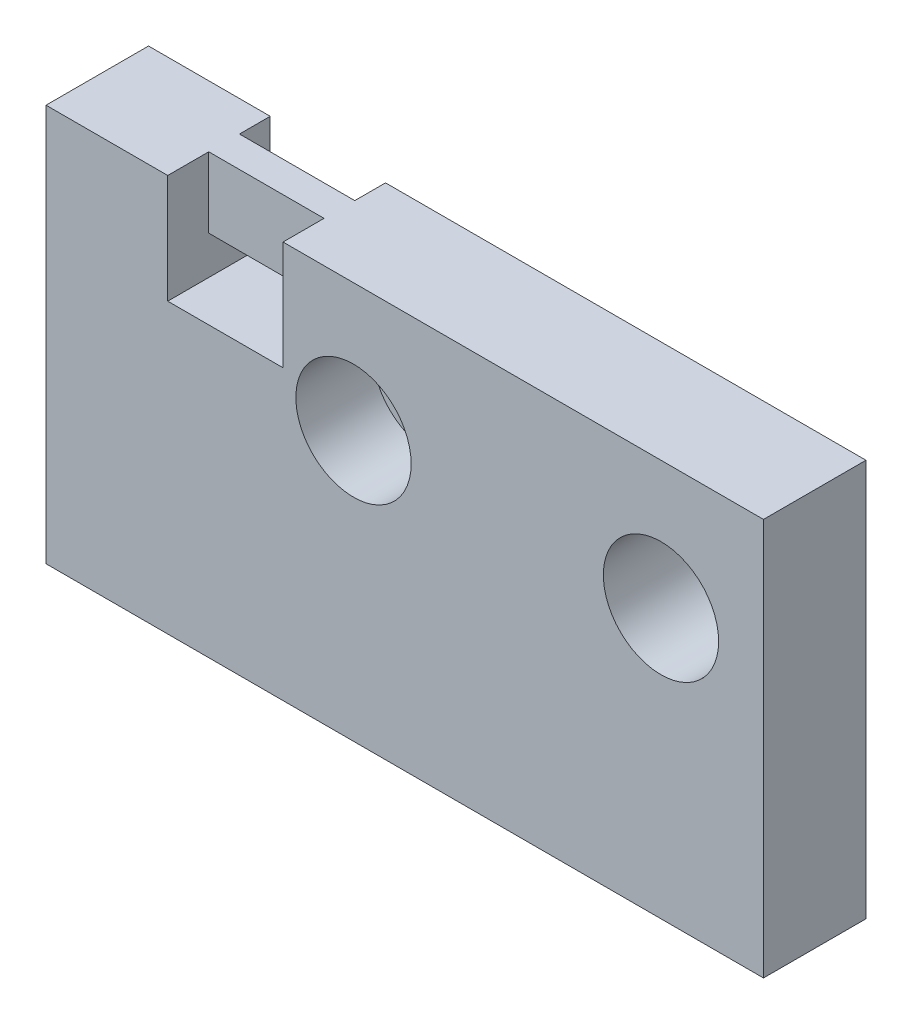
ISO-10303-21;
HEADER;
FILE_DESCRIPTION(('STEP AP214'),'2;1');
FILE_NAME('part.step','',(''),(''),'','','');
FILE_SCHEMA(('AUTOMOTIVE_DESIGN { 1 0 10303 214 1 1 1 1 }'));
ENDSEC;
DATA;
#1=APPLICATION_CONTEXT('core data for automotive mechanical design processes');
#2=APPLICATION_PROTOCOL_DEFINITION('international standard','automotive_design',2000,#1);
#3=PRODUCT_CONTEXT('',#1,'mechanical');
#4=PRODUCT('Part','Part','',(#3));
#5=PRODUCT_RELATED_PRODUCT_CATEGORY('part','',(#4));
#6=PRODUCT_DEFINITION_FORMATION('','',#4);
#7=PRODUCT_DEFINITION_CONTEXT('part definition',#1,'design');
#8=PRODUCT_DEFINITION('design','',#6,#7);
#9=PRODUCT_DEFINITION_SHAPE('','',#8);
#10=(LENGTH_UNIT() NAMED_UNIT(*) SI_UNIT(.MILLI.,.METRE.));
#11=(NAMED_UNIT(*) PLANE_ANGLE_UNIT() SI_UNIT($,.RADIAN.));
#12=(NAMED_UNIT(*) SI_UNIT($,.STERADIAN.) SOLID_ANGLE_UNIT());
#13=UNCERTAINTY_MEASURE_WITH_UNIT(LENGTH_MEASURE(1.E-05),#10,'distance_accuracy_value','');
#14=(GEOMETRIC_REPRESENTATION_CONTEXT(3) GLOBAL_UNCERTAINTY_ASSIGNED_CONTEXT((#13)) GLOBAL_UNIT_ASSIGNED_CONTEXT((#10,
#11,#12)) REPRESENTATION_CONTEXT('',''));
#15=CARTESIAN_POINT('',(0.,0.,0.));
#16=DIRECTION('',(0.,0.,1.));
#17=DIRECTION('',(1.,0.,0.));
#18=AXIS2_PLACEMENT_3D('',#15,#16,#17);
#19=CARTESIAN_POINT('',(12.,-5.,0.));
#20=DIRECTION('',(0.,0.,1.));
#21=DIRECTION('',(1.,0.,0.));
#22=AXIS2_PLACEMENT_3D('',#19,#20,#21);
#23=CYLINDRICAL_SURFACE('',#22,1.25);
#24=CARTESIAN_POINT('',(12.,-5.,0.));
#25=DIRECTION('',(0.,0.,1.));
#26=DIRECTION('',(1.,0.,0.));
#27=AXIS2_PLACEMENT_3D('',#24,#25,#26);
#28=CIRCLE('',#27,1.25);
#29=CARTESIAN_POINT('',(13.25,-5.,0.));
#30=VERTEX_POINT('',#29);
#31=EDGE_CURVE('E187',#30,#30,#28,.T.);
#32=ORIENTED_EDGE('',*,*,#31,.F.);
#33=EDGE_LOOP('',(#32));
#34=FACE_BOUND('',#33,.T.);
#35=CARTESIAN_POINT('',(12.,-5.,1.));
#36=DIRECTION('',(0.,0.,1.));
#37=DIRECTION('',(1.,0.,0.));
#38=AXIS2_PLACEMENT_3D('',#35,#36,#37);
#39=CIRCLE('',#38,1.25);
#40=CARTESIAN_POINT('',(13.25,-5.,1.));
#41=VERTEX_POINT('',#40);
#42=EDGE_CURVE('E181',#41,#41,#39,.F.);
#43=ORIENTED_EDGE('',*,*,#42,.F.);
#44=EDGE_LOOP('',(#43));
#45=FACE_BOUND('',#44,.T.);
#46=ADVANCED_FACE('F33',(#34,#45),#23,.F.);
#47=CARTESIAN_POINT('',(0.,0.,4.));
#48=DIRECTION('',(1.,0.,0.));
#49=DIRECTION('',(0.,1.,0.));
#50=AXIS2_PLACEMENT_3D('',#47,#48,#49);
#51=PLANE('',#50);
#52=DIRECTION('',(0.,-1.,0.));
#53=VECTOR('',#52,1.);
#54=CARTESIAN_POINT('',(0.,0.,0.));
#55=LINE('',#54,#53);
#56=CARTESIAN_POINT('',(0.,0.,0.));
#57=VERTEX_POINT('',#56);
#58=CARTESIAN_POINT('',(0.,-15.5,0.));
#59=VERTEX_POINT('',#58);
#60=EDGE_CURVE('E190',#57,#59,#55,.T.);
#61=ORIENTED_EDGE('',*,*,#60,.T.);
#62=DIRECTION('',(0.,0.,-1.));
#63=VECTOR('',#62,1.);
#64=CARTESIAN_POINT('',(0.,-15.5,4.));
#65=LINE('',#64,#63);
#66=CARTESIAN_POINT('',(0.,-15.5,4.));
#67=VERTEX_POINT('',#66);
#68=EDGE_CURVE('E220',#67,#59,#65,.T.);
#69=ORIENTED_EDGE('',*,*,#68,.F.);
#70=DIRECTION('',(0.,-1.,0.));
#71=VECTOR('',#70,1.);
#72=CARTESIAN_POINT('',(0.,0.,4.));
#73=LINE('',#72,#71);
#74=CARTESIAN_POINT('',(0.,0.,4.));
#75=VERTEX_POINT('',#74);
#76=EDGE_CURVE('E191',#75,#67,#73,.T.);
#77=ORIENTED_EDGE('',*,*,#76,.F.);
#78=DIRECTION('',(0.,0.,-1.));
#79=VECTOR('',#78,1.);
#80=CARTESIAN_POINT('',(0.,0.,4.));
#81=LINE('',#80,#79);
#82=EDGE_CURVE('E203',#75,#57,#81,.T.);
#83=ORIENTED_EDGE('',*,*,#82,.T.);
#84=EDGE_LOOP('',(#61,#69,#77,#83));
#85=FACE_BOUND('',#84,.T.);
#86=ADVANCED_FACE('F35',(#85),#51,.F.);
#87=CARTESIAN_POINT('',(0.,-15.5,4.));
#88=DIRECTION('',(0.,1.,0.));
#89=DIRECTION('',(0.,0.,1.));
#90=AXIS2_PLACEMENT_3D('',#87,#88,#89);
#91=PLANE('',#90);
#92=DIRECTION('',(1.,0.,0.));
#93=VECTOR('',#92,1.);
#94=CARTESIAN_POINT('',(0.,-15.5,0.));
#95=LINE('',#94,#93);
#96=CARTESIAN_POINT('',(28.,-15.5,0.));
#97=VERTEX_POINT('',#96);
#98=EDGE_CURVE('E206',#59,#97,#95,.T.);
#99=ORIENTED_EDGE('',*,*,#98,.T.);
#100=DIRECTION('',(0.,0.,-1.));
#101=VECTOR('',#100,1.);
#102=CARTESIAN_POINT('',(28.,-15.5,4.));
#103=LINE('',#102,#101);
#104=CARTESIAN_POINT('',(28.,-15.5,4.));
#105=VERTEX_POINT('',#104);
#106=EDGE_CURVE('E217',#105,#97,#103,.T.);
#107=ORIENTED_EDGE('',*,*,#106,.F.);
#108=DIRECTION('',(1.,0.,0.));
#109=VECTOR('',#108,1.);
#110=CARTESIAN_POINT('',(0.,-15.5,4.));
#111=LINE('',#110,#109);
#112=EDGE_CURVE('E194',#67,#105,#111,.T.);
#113=ORIENTED_EDGE('',*,*,#112,.F.);
#114=ORIENTED_EDGE('',*,*,#68,.T.);
#115=EDGE_LOOP('',(#99,#107,#113,#114));
#116=FACE_BOUND('',#115,.T.);
#117=ADVANCED_FACE('F279',(#116),#91,.F.);
#118=CARTESIAN_POINT('',(28.,0.,4.));
#119=DIRECTION('',(-1.,0.,0.));
#120=DIRECTION('',(0.,-1.,0.));
#121=AXIS2_PLACEMENT_3D('',#118,#119,#120);
#122=PLANE('',#121);
#123=DIRECTION('',(0.,1.,0.));
#124=VECTOR('',#123,1.);
#125=CARTESIAN_POINT('',(28.,0.,0.));
#126=LINE('',#125,#124);
#127=CARTESIAN_POINT('',(28.,0.,0.));
#128=VERTEX_POINT('',#127);
#129=EDGE_CURVE('E208',#97,#128,#126,.T.);
#130=ORIENTED_EDGE('',*,*,#129,.T.);
#131=DIRECTION('',(0.,0.,-1.));
#132=VECTOR('',#131,1.);
#133=CARTESIAN_POINT('',(28.,0.,4.));
#134=LINE('',#133,#132);
#135=CARTESIAN_POINT('',(28.,0.,4.));
#136=VERTEX_POINT('',#135);
#137=EDGE_CURVE('E214',#136,#128,#134,.T.);
#138=ORIENTED_EDGE('',*,*,#137,.F.);
#139=DIRECTION('',(0.,1.,0.));
#140=VECTOR('',#139,1.);
#141=CARTESIAN_POINT('',(28.,0.,4.));
#142=LINE('',#141,#140);
#143=EDGE_CURVE('E197',#105,#136,#142,.T.);
#144=ORIENTED_EDGE('',*,*,#143,.F.);
#145=ORIENTED_EDGE('',*,*,#106,.T.);
#146=EDGE_LOOP('',(#130,#138,#144,#145));
#147=FACE_BOUND('',#146,.T.);
#148=ADVANCED_FACE('F290',(#147),#122,.F.);
#149=CARTESIAN_POINT('',(0.,0.,4.));
#150=DIRECTION('',(0.,-1.,0.));
#151=DIRECTION('',(0.,0.,-1.));
#152=AXIS2_PLACEMENT_3D('',#149,#150,#151);
#153=PLANE('',#152);
#154=DIRECTION('',(-1.,0.,0.));
#155=VECTOR('',#154,1.);
#156=CARTESIAN_POINT('',(0.,0.,0.));
#157=LINE('',#156,#155);
#158=CARTESIAN_POINT('',(9.25,0.,0.));
#159=VERTEX_POINT('',#158);
#160=EDGE_CURVE('E195',#128,#159,#157,.T.);
#161=ORIENTED_EDGE('',*,*,#160,.T.);
#162=DIRECTION('',(0.,0.,-1.));
#163=VECTOR('',#162,1.);
#164=CARTESIAN_POINT('',(9.25,0.,1.2));
#165=LINE('',#164,#163);
#166=CARTESIAN_POINT('',(9.25,0.,1.2));
#167=VERTEX_POINT('',#166);
#168=EDGE_CURVE('E137',#167,#159,#165,.T.);
#169=ORIENTED_EDGE('',*,*,#168,.F.);
#170=DIRECTION('',(1.,0.,0.));
#171=VECTOR('',#170,1.);
#172=CARTESIAN_POINT('',(9.25,0.,1.2));
#173=LINE('',#172,#171);
#174=CARTESIAN_POINT('',(4.75,0.,1.2));
#175=VERTEX_POINT('',#174);
#176=EDGE_CURVE('E124',#175,#167,#173,.T.);
#177=ORIENTED_EDGE('',*,*,#176,.F.);
#178=DIRECTION('',(0.,0.,-1.));
#179=VECTOR('',#178,1.);
#180=CARTESIAN_POINT('',(4.75,0.,1.2));
#181=LINE('',#180,#179);
#182=CARTESIAN_POINT('',(4.75,0.,0.));
#183=VERTEX_POINT('',#182);
#184=EDGE_CURVE('E130',#175,#183,#181,.T.);
#185=ORIENTED_EDGE('',*,*,#184,.T.);
#186=EDGE_CURVE('E210',#183,#57,#157,.T.);
#187=ORIENTED_EDGE('',*,*,#186,.T.);
#188=ORIENTED_EDGE('',*,*,#82,.F.);
#189=DIRECTION('',(-1.,0.,0.));
#190=VECTOR('',#189,1.);
#191=CARTESIAN_POINT('',(0.,0.,4.));
#192=LINE('',#191,#190);
#193=CARTESIAN_POINT('',(4.75,0.,4.));
#194=VERTEX_POINT('',#193);
#195=EDGE_CURVE('E199',#194,#75,#192,.T.);
#196=ORIENTED_EDGE('',*,*,#195,.F.);
#197=DIRECTION('',(0.,0.,-1.));
#198=VECTOR('',#197,1.);
#199=CARTESIAN_POINT('',(4.75,0.,4.));
#200=LINE('',#199,#198);
#201=CARTESIAN_POINT('',(4.75,0.,2.4));
#202=VERTEX_POINT('',#201);
#203=EDGE_CURVE('E170',#194,#202,#200,.T.);
#204=ORIENTED_EDGE('',*,*,#203,.T.);
#205=DIRECTION('',(1.,0.,0.));
#206=VECTOR('',#205,1.);
#207=CARTESIAN_POINT('',(0.,0.,2.4));
#208=LINE('',#207,#206);
#209=CARTESIAN_POINT('',(9.25,0.,2.4));
#210=VERTEX_POINT('',#209);
#211=EDGE_CURVE('E41',#202,#210,#208,.T.);
#212=ORIENTED_EDGE('',*,*,#211,.T.);
#213=DIRECTION('',(0.,0.,1.));
#214=VECTOR('',#213,1.);
#215=CARTESIAN_POINT('',(9.25,0.,4.));
#216=LINE('',#215,#214);
#217=CARTESIAN_POINT('',(9.25,0.,4.));
#218=VERTEX_POINT('',#217);
#219=EDGE_CURVE('E174',#210,#218,#216,.T.);
#220=ORIENTED_EDGE('',*,*,#219,.T.);
#221=EDGE_CURVE('E200',#136,#218,#192,.T.);
#222=ORIENTED_EDGE('',*,*,#221,.F.);
#223=ORIENTED_EDGE('',*,*,#137,.T.);
#224=EDGE_LOOP('',(#161,#169,#177,#185,#187,#188,#196,#204,#212,#220,#222,#223));
#225=FACE_BOUND('',#224,.T.);
#226=ADVANCED_FACE('F140',(#225),#153,.F.);
#227=CARTESIAN_POINT('',(0.,0.,4.));
#228=DIRECTION('',(0.,0.,1.));
#229=DIRECTION('',(1.,0.,0.));
#230=AXIS2_PLACEMENT_3D('',#227,#228,#229);
#231=PLANE('',#230);
#232=DIRECTION('',(0.,1.,0.));
#233=VECTOR('',#232,1.);
#234=CARTESIAN_POINT('',(9.25,0.25,4.));
#235=LINE('',#234,#233);
#236=CARTESIAN_POINT('',(9.25,-4.25,4.));
#237=VERTEX_POINT('',#236);
#238=EDGE_CURVE('E164',#237,#218,#235,.T.);
#239=ORIENTED_EDGE('',*,*,#238,.F.);
#240=DIRECTION('',(1.,0.,0.));
#241=VECTOR('',#240,1.);
#242=CARTESIAN_POINT('',(9.25,-4.25,4.));
#243=LINE('',#242,#241);
#244=CARTESIAN_POINT('',(4.75,-4.25,4.));
#245=VERTEX_POINT('',#244);
#246=EDGE_CURVE('E159',#245,#237,#243,.T.);
#247=ORIENTED_EDGE('',*,*,#246,.F.);
#248=DIRECTION('',(0.,-1.,0.));
#249=VECTOR('',#248,1.);
#250=CARTESIAN_POINT('',(4.75,0.,4.));
#251=LINE('',#250,#249);
#252=EDGE_CURVE('E223',#194,#245,#251,.T.);
#253=ORIENTED_EDGE('',*,*,#252,.F.);
#254=ORIENTED_EDGE('',*,*,#195,.T.);
#255=ORIENTED_EDGE('',*,*,#76,.T.);
#256=ORIENTED_EDGE('',*,*,#112,.T.);
#257=ORIENTED_EDGE('',*,*,#143,.T.);
#258=ORIENTED_EDGE('',*,*,#221,.T.);
#259=EDGE_LOOP('',(#239,#247,#253,#254,#255,#256,#257,#258));
#260=FACE_BOUND('',#259,.T.);
#261=CARTESIAN_POINT('',(12.,-5.,4.));
#262=DIRECTION('',(0.,0.,1.));
#263=DIRECTION('',(1.,0.,0.));
#264=AXIS2_PLACEMENT_3D('',#261,#262,#263);
#265=CIRCLE('',#264,2.25);
#266=CARTESIAN_POINT('',(14.25,-5.,4.));
#267=VERTEX_POINT('',#266);
#268=EDGE_CURVE('E182',#267,#267,#265,.T.);
#269=ORIENTED_EDGE('',*,*,#268,.F.);
#270=EDGE_LOOP('',(#269));
#271=FACE_BOUND('',#270,.T.);
#272=CARTESIAN_POINT('',(24.,-5.,4.));
#273=DIRECTION('',(0.,0.,1.));
#274=DIRECTION('',(1.,0.,0.));
#275=AXIS2_PLACEMENT_3D('',#272,#273,#274);
#276=CIRCLE('',#275,2.25);
#277=CARTESIAN_POINT('',(26.25,-5.,4.));
#278=VERTEX_POINT('',#277);
#279=EDGE_CURVE('E177',#278,#278,#276,.T.);
#280=ORIENTED_EDGE('',*,*,#279,.F.);
#281=EDGE_LOOP('',(#280));
#282=FACE_BOUND('',#281,.T.);
#283=ADVANCED_FACE('F244',(#260,#271,#282),#231,.T.);
#284=CARTESIAN_POINT('',(0.,0.,0.));
#285=DIRECTION('',(0.,0.,1.));
#286=DIRECTION('',(1.,0.,0.));
#287=AXIS2_PLACEMENT_3D('',#284,#285,#286);
#288=PLANE('',#287);
#289=CARTESIAN_POINT('',(24.,-5.,0.));
#290=DIRECTION('',(0.,0.,1.));
#291=DIRECTION('',(1.,0.,0.));
#292=AXIS2_PLACEMENT_3D('',#289,#290,#291);
#293=CIRCLE('',#292,2.25);
#294=CARTESIAN_POINT('',(26.25,-5.,0.));
#295=VERTEX_POINT('',#294);
#296=EDGE_CURVE('E253',#295,#295,#293,.T.);
#297=ORIENTED_EDGE('',*,*,#296,.T.);
#298=EDGE_LOOP('',(#297));
#299=FACE_BOUND('',#298,.T.);
#300=ORIENTED_EDGE('',*,*,#31,.T.);
#301=EDGE_LOOP('',(#300));
#302=FACE_BOUND('',#301,.T.);
#303=DIRECTION('',(0.,1.,0.));
#304=VECTOR('',#303,1.);
#305=CARTESIAN_POINT('',(9.25,0.,0.));
#306=LINE('',#305,#304);
#307=CARTESIAN_POINT('',(9.25,-4.25,0.));
#308=VERTEX_POINT('',#307);
#309=EDGE_CURVE('E156',#308,#159,#306,.T.);
#310=ORIENTED_EDGE('',*,*,#309,.T.);
#311=ORIENTED_EDGE('',*,*,#160,.F.);
#312=ORIENTED_EDGE('',*,*,#129,.F.);
#313=ORIENTED_EDGE('',*,*,#98,.F.);
#314=ORIENTED_EDGE('',*,*,#60,.F.);
#315=ORIENTED_EDGE('',*,*,#186,.F.);
#316=DIRECTION('',(0.,-1.,0.));
#317=VECTOR('',#316,1.);
#318=CARTESIAN_POINT('',(4.75,0.,0.));
#319=LINE('',#318,#317);
#320=CARTESIAN_POINT('',(4.75,-4.25,0.));
#321=VERTEX_POINT('',#320);
#322=EDGE_CURVE('E134',#183,#321,#319,.T.);
#323=ORIENTED_EDGE('',*,*,#322,.T.);
#324=DIRECTION('',(1.,0.,0.));
#325=VECTOR('',#324,1.);
#326=CARTESIAN_POINT('',(0.,-4.25,0.));
#327=LINE('',#326,#325);
#328=EDGE_CURVE('E152',#321,#308,#327,.T.);
#329=ORIENTED_EDGE('',*,*,#328,.T.);
#330=EDGE_LOOP('',(#310,#311,#312,#313,#314,#315,#323,#329));
#331=FACE_BOUND('',#330,.T.);
#332=ADVANCED_FACE('F252',(#299,#302,#331),#288,.F.);
#333=CARTESIAN_POINT('',(12.,-5.,1.));
#334=DIRECTION('',(0.,0.,1.));
#335=DIRECTION('',(1.,0.,0.));
#336=AXIS2_PLACEMENT_3D('',#333,#334,#335);
#337=PLANE('',#336);
#338=CARTESIAN_POINT('',(12.,-5.,1.));
#339=DIRECTION('',(0.,0.,1.));
#340=DIRECTION('',(1.,0.,0.));
#341=AXIS2_PLACEMENT_3D('',#338,#339,#340);
#342=CIRCLE('',#341,2.25);
#343=CARTESIAN_POINT('',(14.25,-5.,1.));
#344=VERTEX_POINT('',#343);
#345=EDGE_CURVE('E178',#344,#344,#342,.T.);
#346=ORIENTED_EDGE('',*,*,#345,.T.);
#347=EDGE_LOOP('',(#346));
#348=FACE_BOUND('',#347,.T.);
#349=ORIENTED_EDGE('',*,*,#42,.T.);
#350=EDGE_LOOP('',(#349));
#351=FACE_BOUND('',#350,.T.);
#352=ADVANCED_FACE('F270',(#348,#351),#337,.T.);
#353=CARTESIAN_POINT('',(12.,-5.,1.));
#354=DIRECTION('',(0.,0.,1.));
#355=DIRECTION('',(1.,0.,0.));
#356=AXIS2_PLACEMENT_3D('',#353,#354,#355);
#357=CYLINDRICAL_SURFACE('',#356,2.25);
#358=ORIENTED_EDGE('',*,*,#345,.F.);
#359=EDGE_LOOP('',(#358));
#360=FACE_BOUND('',#359,.T.);
#361=ORIENTED_EDGE('',*,*,#268,.T.);
#362=EDGE_LOOP('',(#361));
#363=FACE_BOUND('',#362,.T.);
#364=ADVANCED_FACE('F262',(#360,#363),#357,.F.);
#365=CARTESIAN_POINT('',(24.,-5.,1.));
#366=DIRECTION('',(0.,0.,1.));
#367=DIRECTION('',(1.,0.,0.));
#368=AXIS2_PLACEMENT_3D('',#365,#366,#367);
#369=CYLINDRICAL_SURFACE('',#368,2.25);
#370=ORIENTED_EDGE('',*,*,#279,.T.);
#371=EDGE_LOOP('',(#370));
#372=FACE_BOUND('',#371,.T.);
#373=ORIENTED_EDGE('',*,*,#296,.F.);
#374=EDGE_LOOP('',(#373));
#375=FACE_BOUND('',#374,.T.);
#376=ADVANCED_FACE('F260',(#372,#375),#369,.F.);
#377=CARTESIAN_POINT('',(0.,0.,2.4));
#378=DIRECTION('',(0.,0.,-1.));
#379=DIRECTION('',(-1.,0.,0.));
#380=AXIS2_PLACEMENT_3D('',#377,#378,#379);
#381=PLANE('',#380);
#382=DIRECTION('',(0.,-1.,0.));
#383=VECTOR('',#382,1.);
#384=CARTESIAN_POINT('',(4.75,-4.25,2.4));
#385=LINE('',#384,#383);
#386=CARTESIAN_POINT('',(4.75,-2.75,2.4));
#387=VERTEX_POINT('',#386);
#388=EDGE_CURVE('E160',#202,#387,#385,.T.);
#389=ORIENTED_EDGE('',*,*,#388,.T.);
#390=DIRECTION('',(-1.,0.,0.));
#391=VECTOR('',#390,1.);
#392=CARTESIAN_POINT('',(4.75,-2.75,2.4));
#393=LINE('',#392,#391);
#394=CARTESIAN_POINT('',(9.25,-2.75,2.4));
#395=VERTEX_POINT('',#394);
#396=EDGE_CURVE('E145',#395,#387,#393,.T.);
#397=ORIENTED_EDGE('',*,*,#396,.F.);
#398=DIRECTION('',(0.,1.,0.));
#399=VECTOR('',#398,1.);
#400=CARTESIAN_POINT('',(9.25,0.25,2.4));
#401=LINE('',#400,#399);
#402=EDGE_CURVE('E163',#395,#210,#401,.T.);
#403=ORIENTED_EDGE('',*,*,#402,.T.);
#404=ORIENTED_EDGE('',*,*,#211,.F.);
#405=EDGE_LOOP('',(#389,#397,#403,#404));
#406=FACE_BOUND('',#405,.T.);
#407=ADVANCED_FACE('F232',(#406),#381,.F.);
#408=CARTESIAN_POINT('',(9.25,0.25,2.4));
#409=DIRECTION('',(1.,0.,0.));
#410=DIRECTION('',(0.,0.,-1.));
#411=AXIS2_PLACEMENT_3D('',#408,#409,#410);
#412=PLANE('',#411);
#413=DIRECTION('',(0.,0.,1.));
#414=VECTOR('',#413,1.);
#415=CARTESIAN_POINT('',(9.25,-2.75,-1.6));
#416=LINE('',#415,#414);
#417=CARTESIAN_POINT('',(9.25,-2.75,1.2));
#418=VERTEX_POINT('',#417);
#419=EDGE_CURVE('E149',#418,#395,#416,.T.);
#420=ORIENTED_EDGE('',*,*,#419,.F.);
#421=DIRECTION('',(0.,-1.,0.));
#422=VECTOR('',#421,1.);
#423=CARTESIAN_POINT('',(9.25,-4.25,1.2));
#424=LINE('',#423,#422);
#425=EDGE_CURVE('E48',#167,#418,#424,.T.);
#426=ORIENTED_EDGE('',*,*,#425,.F.);
#427=ORIENTED_EDGE('',*,*,#168,.T.);
#428=ORIENTED_EDGE('',*,*,#309,.F.);
#429=DIRECTION('',(0.,0.,1.));
#430=VECTOR('',#429,1.);
#431=CARTESIAN_POINT('',(9.25,-4.25,2.4));
#432=LINE('',#431,#430);
#433=EDGE_CURVE('E55',#308,#237,#432,.T.);
#434=ORIENTED_EDGE('',*,*,#433,.T.);
#435=ORIENTED_EDGE('',*,*,#238,.T.);
#436=ORIENTED_EDGE('',*,*,#219,.F.);
#437=ORIENTED_EDGE('',*,*,#402,.F.);
#438=EDGE_LOOP('',(#420,#426,#427,#428,#434,#435,#436,#437));
#439=FACE_BOUND('',#438,.T.);
#440=ADVANCED_FACE('F240',(#439),#412,.F.);
#441=CARTESIAN_POINT('',(4.75,-4.25,2.4));
#442=DIRECTION('',(-1.,0.,0.));
#443=DIRECTION('',(0.,0.,1.));
#444=AXIS2_PLACEMENT_3D('',#441,#442,#443);
#445=PLANE('',#444);
#446=ORIENTED_EDGE('',*,*,#252,.T.);
#447=DIRECTION('',(0.,0.,1.));
#448=VECTOR('',#447,1.);
#449=CARTESIAN_POINT('',(4.75,-4.25,2.4));
#450=LINE('',#449,#448);
#451=EDGE_CURVE('E166',#321,#245,#450,.T.);
#452=ORIENTED_EDGE('',*,*,#451,.F.);
#453=ORIENTED_EDGE('',*,*,#322,.F.);
#454=ORIENTED_EDGE('',*,*,#184,.F.);
#455=DIRECTION('',(0.,1.,0.));
#456=VECTOR('',#455,1.);
#457=CARTESIAN_POINT('',(4.75,-4.25,1.2));
#458=LINE('',#457,#456);
#459=CARTESIAN_POINT('',(4.75,-2.75,1.2));
#460=VERTEX_POINT('',#459);
#461=EDGE_CURVE('E120',#460,#175,#458,.T.);
#462=ORIENTED_EDGE('',*,*,#461,.F.);
#463=DIRECTION('',(0.,0.,1.));
#464=VECTOR('',#463,1.);
#465=CARTESIAN_POINT('',(4.75,-2.75,-1.6));
#466=LINE('',#465,#464);
#467=EDGE_CURVE('E150',#460,#387,#466,.T.);
#468=ORIENTED_EDGE('',*,*,#467,.T.);
#469=ORIENTED_EDGE('',*,*,#388,.F.);
#470=ORIENTED_EDGE('',*,*,#203,.F.);
#471=EDGE_LOOP('',(#446,#452,#453,#454,#462,#468,#469,#470));
#472=FACE_BOUND('',#471,.T.);
#473=ADVANCED_FACE('F132',(#472),#445,.F.);
#474=CARTESIAN_POINT('',(9.25,-4.25,2.4));
#475=DIRECTION('',(0.,-1.,0.));
#476=DIRECTION('',(1.,0.,0.));
#477=AXIS2_PLACEMENT_3D('',#474,#475,#476);
#478=PLANE('',#477);
#479=ORIENTED_EDGE('',*,*,#246,.T.);
#480=ORIENTED_EDGE('',*,*,#433,.F.);
#481=ORIENTED_EDGE('',*,*,#328,.F.);
#482=ORIENTED_EDGE('',*,*,#451,.T.);
#483=EDGE_LOOP('',(#479,#480,#481,#482));
#484=FACE_BOUND('',#483,.T.);
#485=ADVANCED_FACE('F301',(#484),#478,.F.);
#486=CARTESIAN_POINT('',(4.75,-2.75,-1.6));
#487=DIRECTION('',(0.,1.,0.));
#488=DIRECTION('',(0.,0.,1.));
#489=AXIS2_PLACEMENT_3D('',#486,#487,#488);
#490=PLANE('',#489);
#491=ORIENTED_EDGE('',*,*,#467,.F.);
#492=DIRECTION('',(1.,0.,0.));
#493=VECTOR('',#492,1.);
#494=CARTESIAN_POINT('',(4.75,-2.75,1.2));
#495=LINE('',#494,#493);
#496=EDGE_CURVE('E11',#460,#418,#495,.T.);
#497=ORIENTED_EDGE('',*,*,#496,.T.);
#498=ORIENTED_EDGE('',*,*,#419,.T.);
#499=ORIENTED_EDGE('',*,*,#396,.T.);
#500=EDGE_LOOP('',(#491,#497,#498,#499));
#501=FACE_BOUND('',#500,.T.);
#502=ADVANCED_FACE('F237',(#501),#490,.F.);
#503=CARTESIAN_POINT('',(0.,0.,1.2));
#504=DIRECTION('',(0.,0.,1.));
#505=DIRECTION('',(1.,0.,0.));
#506=AXIS2_PLACEMENT_3D('',#503,#504,#505);
#507=PLANE('',#506);
#508=ORIENTED_EDGE('',*,*,#461,.T.);
#509=ORIENTED_EDGE('',*,*,#176,.T.);
#510=ORIENTED_EDGE('',*,*,#425,.T.);
#511=ORIENTED_EDGE('',*,*,#496,.F.);
#512=EDGE_LOOP('',(#508,#509,#510,#511));
#513=FACE_BOUND('',#512,.T.);
#514=ADVANCED_FACE('F122',(#513),#507,.F.);
#515=CLOSED_SHELL('',(#46,#86,#117,#148,#226,#283,#332,#352,#364,#376,#407,#440,#473,#485,#502,#514));
#516=MANIFOLD_SOLID_BREP('B2',#515);
#517=ADVANCED_BREP_SHAPE_REPRESENTATION('',(#18,#516),#14);
#518=SHAPE_DEFINITION_REPRESENTATION(#9,#517);
ENDSEC;
END-ISO-10303-21;
